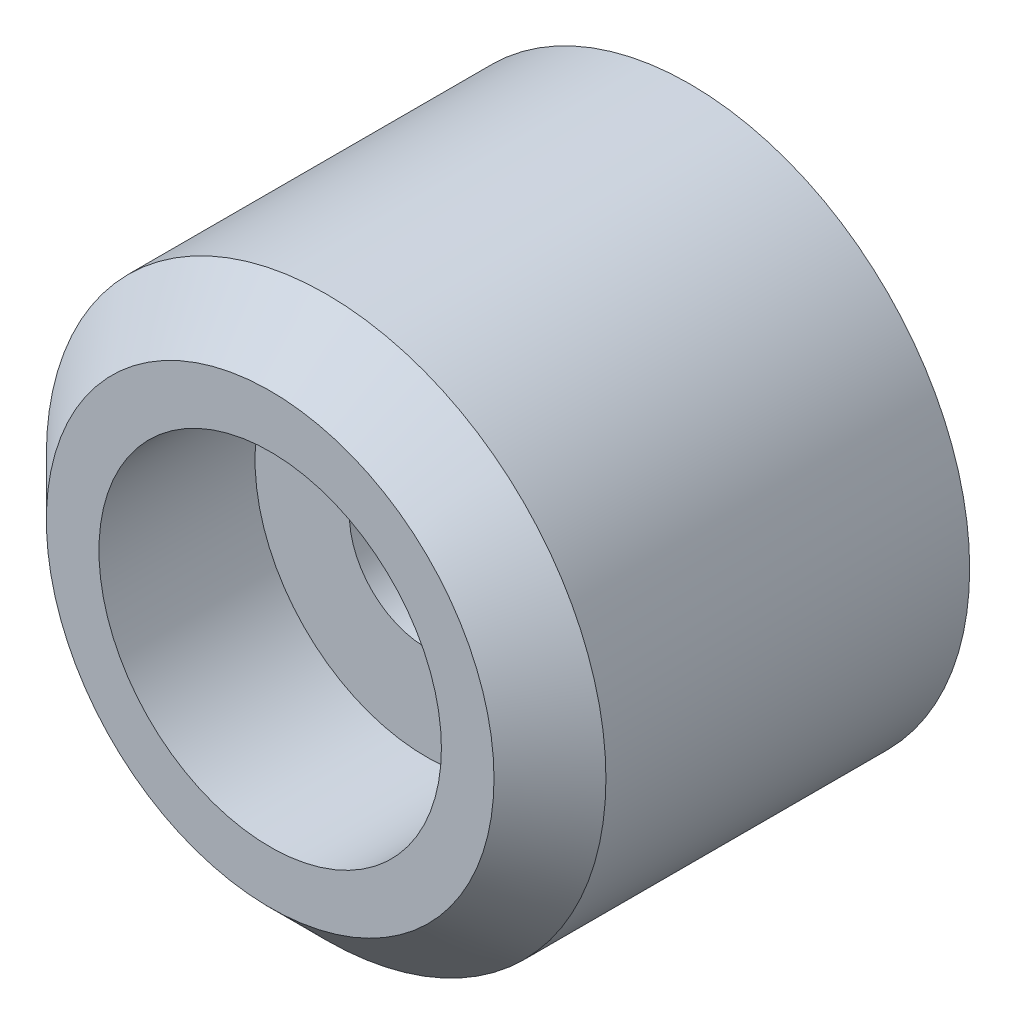
ISO-10303-21;
HEADER;
FILE_DESCRIPTION(('STEP AP214'),'2;1');
FILE_NAME('part.step','',(''),(''),'','','');
FILE_SCHEMA(('AUTOMOTIVE_DESIGN { 1 0 10303 214 1 1 1 1 }'));
ENDSEC;
DATA;
#1=APPLICATION_CONTEXT('core data for automotive mechanical design processes');
#2=APPLICATION_PROTOCOL_DEFINITION('international standard','automotive_design',2000,#1);
#3=PRODUCT_CONTEXT('',#1,'mechanical');
#4=PRODUCT('Part','Part','',(#3));
#5=PRODUCT_RELATED_PRODUCT_CATEGORY('part','',(#4));
#6=PRODUCT_DEFINITION_FORMATION('','',#4);
#7=PRODUCT_DEFINITION_CONTEXT('part definition',#1,'design');
#8=PRODUCT_DEFINITION('design','',#6,#7);
#9=PRODUCT_DEFINITION_SHAPE('','',#8);
#10=(LENGTH_UNIT() NAMED_UNIT(*) SI_UNIT(.MILLI.,.METRE.));
#11=(NAMED_UNIT(*) PLANE_ANGLE_UNIT() SI_UNIT($,.RADIAN.));
#12=(NAMED_UNIT(*) SI_UNIT($,.STERADIAN.) SOLID_ANGLE_UNIT());
#13=UNCERTAINTY_MEASURE_WITH_UNIT(LENGTH_MEASURE(1.E-05),#10,'distance_accuracy_value','');
#14=(GEOMETRIC_REPRESENTATION_CONTEXT(3) GLOBAL_UNCERTAINTY_ASSIGNED_CONTEXT((#13)) GLOBAL_UNIT_ASSIGNED_CONTEXT((#10,
#11,#12)) REPRESENTATION_CONTEXT('',''));
#15=CARTESIAN_POINT('',(0.,0.,0.));
#16=DIRECTION('',(0.,0.,1.));
#17=DIRECTION('',(1.,0.,0.));
#18=AXIS2_PLACEMENT_3D('',#15,#16,#17);
#19=CARTESIAN_POINT('',(0.,0.,15.));
#20=DIRECTION('',(0.,0.,-1.));
#21=DIRECTION('',(-1.,0.,0.));
#22=AXIS2_PLACEMENT_3D('',#19,#20,#21);
#23=CYLINDRICAL_SURFACE('',#22,10.);
#24=CARTESIAN_POINT('',(0.,0.,13.));
#25=DIRECTION('',(0.,0.,1.));
#26=DIRECTION('',(1.,0.,0.));
#27=AXIS2_PLACEMENT_3D('',#24,#25,#26);
#28=CIRCLE('',#27,10.);
#29=CARTESIAN_POINT('',(10.,0.,13.));
#30=VERTEX_POINT('',#29);
#31=EDGE_CURVE('E10',#30,#30,#28,.F.);
#32=ORIENTED_EDGE('',*,*,#31,.T.);
#33=EDGE_LOOP('',(#32));
#34=FACE_BOUND('',#33,.T.);
#35=CARTESIAN_POINT('',(0.,0.,0.));
#36=DIRECTION('',(0.,0.,1.));
#37=DIRECTION('',(1.,0.,0.));
#38=AXIS2_PLACEMENT_3D('',#35,#36,#37);
#39=CIRCLE('',#38,10.);
#40=CARTESIAN_POINT('',(10.,0.,0.));
#41=VERTEX_POINT('',#40);
#42=EDGE_CURVE('E40',#41,#41,#39,.T.);
#43=ORIENTED_EDGE('',*,*,#42,.T.);
#44=EDGE_LOOP('',(#43));
#45=FACE_BOUND('',#44,.T.);
#46=ADVANCED_FACE('F29',(#34,#45),#23,.T.);
#47=CARTESIAN_POINT('',(0.,0.,15.));
#48=DIRECTION('',(0.,0.,1.));
#49=DIRECTION('',(1.,0.,0.));
#50=AXIS2_PLACEMENT_3D('',#47,#48,#49);
#51=PLANE('',#50);
#52=CARTESIAN_POINT('',(0.,0.,15.));
#53=DIRECTION('',(0.,0.,1.));
#54=DIRECTION('',(1.,0.,0.));
#55=AXIS2_PLACEMENT_3D('',#52,#53,#54);
#56=CIRCLE('',#55,6.12);
#57=CARTESIAN_POINT('',(6.12,0.,15.));
#58=VERTEX_POINT('',#57);
#59=EDGE_CURVE('E55',#58,#58,#56,.T.);
#60=ORIENTED_EDGE('',*,*,#59,.F.);
#61=EDGE_LOOP('',(#60));
#62=FACE_BOUND('',#61,.T.);
#63=CARTESIAN_POINT('',(0.,0.,15.));
#64=DIRECTION('',(0.,0.,1.));
#65=DIRECTION('',(1.,0.,0.));
#66=AXIS2_PLACEMENT_3D('',#63,#64,#65);
#67=CIRCLE('',#66,8.00000000000001);
#68=CARTESIAN_POINT('',(8.00000000000001,0.,15.));
#69=VERTEX_POINT('',#68);
#70=EDGE_CURVE('E36',#69,#69,#67,.T.);
#71=ORIENTED_EDGE('',*,*,#70,.T.);
#72=EDGE_LOOP('',(#71));
#73=FACE_BOUND('',#72,.T.);
#74=ADVANCED_FACE('F61',(#62,#73),#51,.T.);
#75=CARTESIAN_POINT('',(0.,0.,0.));
#76=DIRECTION('',(0.,0.,1.));
#77=DIRECTION('',(1.,0.,0.));
#78=AXIS2_PLACEMENT_3D('',#75,#76,#77);
#79=PLANE('',#78);
#80=CARTESIAN_POINT('',(0.,0.,0.));
#81=DIRECTION('',(0.,0.,1.));
#82=DIRECTION('',(1.,0.,0.));
#83=AXIS2_PLACEMENT_3D('',#80,#81,#82);
#84=CIRCLE('',#83,2.75);
#85=CARTESIAN_POINT('',(2.75,0.,0.));
#86=VERTEX_POINT('',#85);
#87=EDGE_CURVE('E44',#86,#86,#84,.T.);
#88=ORIENTED_EDGE('',*,*,#87,.T.);
#89=EDGE_LOOP('',(#88));
#90=FACE_BOUND('',#89,.T.);
#91=ORIENTED_EDGE('',*,*,#42,.F.);
#92=EDGE_LOOP('',(#91));
#93=FACE_BOUND('',#92,.T.);
#94=ADVANCED_FACE('F63',(#90,#93),#79,.F.);
#95=CARTESIAN_POINT('',(0.,0.,15.));
#96=DIRECTION('',(0.,0.,-1.));
#97=DIRECTION('',(-1.,0.,0.));
#98=AXIS2_PLACEMENT_3D('',#95,#96,#97);
#99=CONICAL_SURFACE('',#98,8.00000000000001,0.785398163397446);
#100=ORIENTED_EDGE('',*,*,#31,.F.);
#101=EDGE_LOOP('',(#100));
#102=FACE_BOUND('',#101,.T.);
#103=ORIENTED_EDGE('',*,*,#70,.F.);
#104=EDGE_LOOP('',(#103));
#105=FACE_BOUND('',#104,.T.);
#106=ADVANCED_FACE('F31',(#102,#105),#99,.T.);
#107=CARTESIAN_POINT('',(0.,0.,15.));
#108=DIRECTION('',(0.,0.,1.));
#109=DIRECTION('',(1.,0.,0.));
#110=AXIS2_PLACEMENT_3D('',#107,#108,#109);
#111=CYLINDRICAL_SURFACE('',#110,2.75);
#112=ORIENTED_EDGE('',*,*,#87,.F.);
#113=EDGE_LOOP('',(#112));
#114=FACE_BOUND('',#113,.T.);
#115=CARTESIAN_POINT('',(0.,0.,9.42));
#116=DIRECTION('',(0.,0.,1.));
#117=DIRECTION('',(1.,0.,0.));
#118=AXIS2_PLACEMENT_3D('',#115,#116,#117);
#119=CIRCLE('',#118,2.75);
#120=CARTESIAN_POINT('',(2.75,0.,9.42));
#121=VERTEX_POINT('',#120);
#122=EDGE_CURVE('E49',#121,#121,#119,.T.);
#123=ORIENTED_EDGE('',*,*,#122,.T.);
#124=EDGE_LOOP('',(#123));
#125=FACE_BOUND('',#124,.T.);
#126=ADVANCED_FACE('F72',(#114,#125),#111,.F.);
#127=CARTESIAN_POINT('',(2.75,0.,9.42));
#128=DIRECTION('',(0.,0.,-1.));
#129=DIRECTION('',(-1.,0.,0.));
#130=AXIS2_PLACEMENT_3D('',#127,#128,#129);
#131=PLANE('',#130);
#132=ORIENTED_EDGE('',*,*,#122,.F.);
#133=EDGE_LOOP('',(#132));
#134=FACE_BOUND('',#133,.T.);
#135=CARTESIAN_POINT('',(0.,0.,9.42));
#136=DIRECTION('',(0.,0.,1.));
#137=DIRECTION('',(1.,0.,0.));
#138=AXIS2_PLACEMENT_3D('',#135,#136,#137);
#139=CIRCLE('',#138,6.12);
#140=CARTESIAN_POINT('',(6.12,0.,9.42));
#141=VERTEX_POINT('',#140);
#142=EDGE_CURVE('E52',#141,#141,#139,.T.);
#143=ORIENTED_EDGE('',*,*,#142,.T.);
#144=EDGE_LOOP('',(#143));
#145=FACE_BOUND('',#144,.T.);
#146=ADVANCED_FACE('F75',(#134,#145),#131,.F.);
#147=CARTESIAN_POINT('',(0.,0.,15.));
#148=DIRECTION('',(0.,0.,1.));
#149=DIRECTION('',(1.,0.,0.));
#150=AXIS2_PLACEMENT_3D('',#147,#148,#149);
#151=CYLINDRICAL_SURFACE('',#150,6.12);
#152=ORIENTED_EDGE('',*,*,#142,.F.);
#153=EDGE_LOOP('',(#152));
#154=FACE_BOUND('',#153,.T.);
#155=ORIENTED_EDGE('',*,*,#59,.T.);
#156=EDGE_LOOP('',(#155));
#157=FACE_BOUND('',#156,.T.);
#158=ADVANCED_FACE('F59',(#154,#157),#151,.F.);
#159=CLOSED_SHELL('',(#46,#74,#94,#106,#126,#146,#158));
#160=MANIFOLD_SOLID_BREP('B2',#159);
#161=ADVANCED_BREP_SHAPE_REPRESENTATION('',(#18,#160),#14);
#162=SHAPE_DEFINITION_REPRESENTATION(#9,#161);
ENDSEC;
END-ISO-10303-21;
